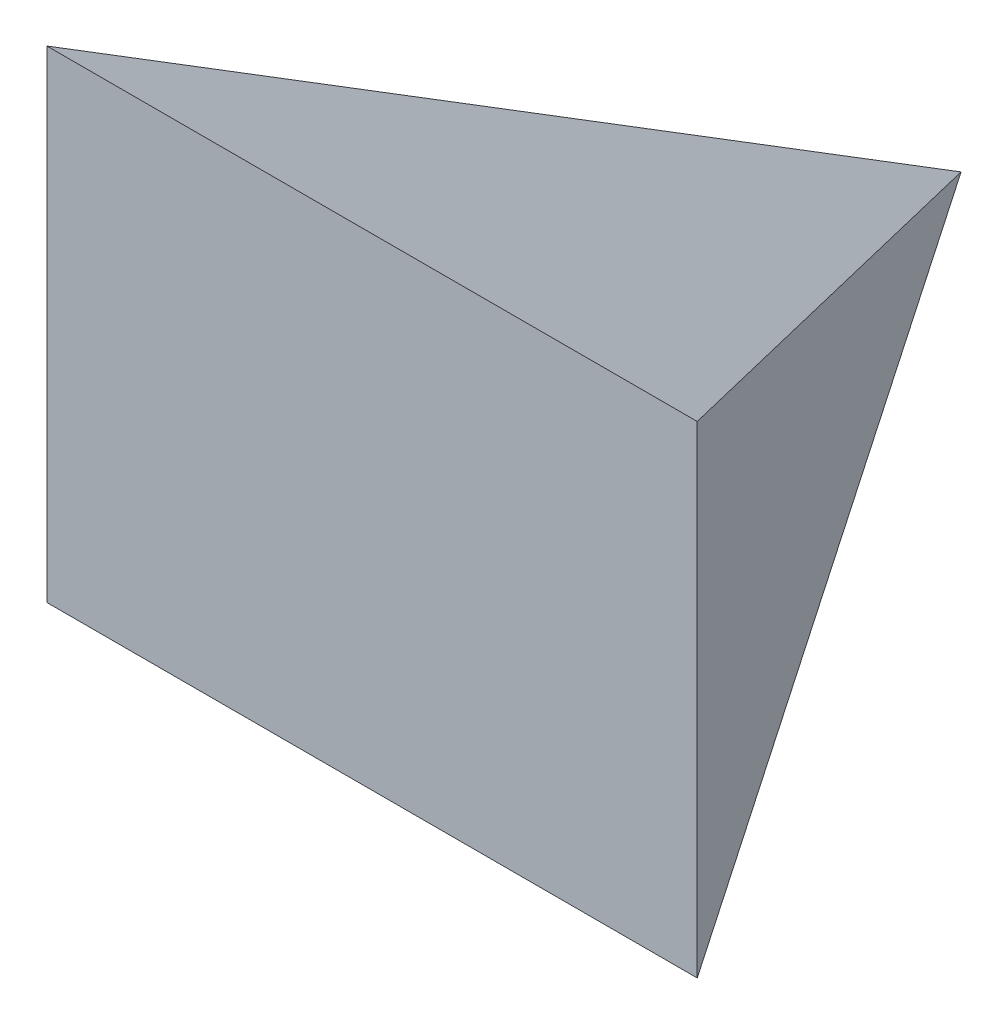
ISO-10303-21;
HEADER;
FILE_DESCRIPTION(('STEP AP214'),'2;1');
FILE_NAME('part.step','',(''),(''),'','','');
FILE_SCHEMA(('AUTOMOTIVE_DESIGN { 1 0 10303 214 1 1 1 1 }'));
ENDSEC;
DATA;
#1=APPLICATION_CONTEXT('core data for automotive mechanical design processes');
#2=APPLICATION_PROTOCOL_DEFINITION('international standard','automotive_design',2000,#1);
#3=PRODUCT_CONTEXT('',#1,'mechanical');
#4=PRODUCT('Part','Part','',(#3));
#5=PRODUCT_RELATED_PRODUCT_CATEGORY('part','',(#4));
#6=PRODUCT_DEFINITION_FORMATION('','',#4);
#7=PRODUCT_DEFINITION_CONTEXT('part definition',#1,'design');
#8=PRODUCT_DEFINITION('design','',#6,#7);
#9=PRODUCT_DEFINITION_SHAPE('','',#8);
#10=(LENGTH_UNIT() NAMED_UNIT(*) SI_UNIT(.MILLI.,.METRE.));
#11=(NAMED_UNIT(*) PLANE_ANGLE_UNIT() SI_UNIT($,.RADIAN.));
#12=(NAMED_UNIT(*) SI_UNIT($,.STERADIAN.) SOLID_ANGLE_UNIT());
#13=UNCERTAINTY_MEASURE_WITH_UNIT(LENGTH_MEASURE(1.E-05),#10,'distance_accuracy_value','');
#14=(GEOMETRIC_REPRESENTATION_CONTEXT(3) GLOBAL_UNCERTAINTY_ASSIGNED_CONTEXT((#13)) GLOBAL_UNIT_ASSIGNED_CONTEXT((#10,
#11,#12)) REPRESENTATION_CONTEXT('',''));
#15=CARTESIAN_POINT('',(0.,0.,0.));
#16=DIRECTION('',(0.,0.,1.));
#17=DIRECTION('',(1.,0.,0.));
#18=AXIS2_PLACEMENT_3D('',#15,#16,#17);
#19=CARTESIAN_POINT('',(165.608897339706,250.,300.));
#20=DIRECTION('',(-0.875464527000019,0.,0.483282383255));
#21=DIRECTION('',(0.483282383255,0.,0.875464527000019));
#22=AXIS2_PLACEMENT_3D('',#19,#20,#21);
#23=PLANE('',#22);
#24=DIRECTION('',(0.45498022040098,-0.337187178210936,0.824195247434746));
#25=VECTOR('',#24,1.);
#26=CARTESIAN_POINT('',(127.603274686984,30.432838191824,231.152933332871));
#27=LINE('',#26,#25);
#28=CARTESIAN_POINT('',(0.,125.,0.));
#29=VERTEX_POINT('',#28);
#30=CARTESIAN_POINT('',(165.608897339706,2.266759571688,300.));
#31=VERTEX_POINT('',#30);
#32=EDGE_CURVE('E66',#29,#31,#27,.T.);
#33=ORIENTED_EDGE('',*,*,#32,.F.);
#34=DIRECTION('',(-0.45498022040098,-0.337187178210936,-0.824195247434746));
#35=VECTOR('',#34,1.);
#36=CARTESIAN_POINT('',(165.956648851683,247.990960095639,300.629950777217));
#37=LINE('',#36,#35);
#38=CARTESIAN_POINT('',(165.608897339706,247.733240428312,300.));
#39=VERTEX_POINT('',#38);
#40=EDGE_CURVE('E80',#39,#29,#37,.T.);
#41=ORIENTED_EDGE('',*,*,#40,.F.);
#42=DIRECTION('',(0.,-1.,0.));
#43=VECTOR('',#42,1.);
#44=CARTESIAN_POINT('',(165.608897339706,250.,300.));
#45=LINE('',#44,#43);
#46=EDGE_CURVE('E44',#39,#31,#45,.T.);
#47=ORIENTED_EDGE('',*,*,#46,.T.);
#48=EDGE_LOOP('',(#33,#41,#47));
#49=FACE_BOUND('',#48,.T.);
#50=ADVANCED_FACE('F37',(#49),#23,.F.);
#51=CARTESIAN_POINT('',(0.,250.,0.));
#52=DIRECTION('',(0.875464527000019,0.,0.483282383255));
#53=DIRECTION('',(0.483282383255,0.,-0.875464527000019));
#54=AXIS2_PLACEMENT_3D('',#51,#52,#53);
#55=PLANE('',#54);
#56=DIRECTION('',(0.45498022040098,0.337187178210936,-0.824195247434746));
#57=VECTOR('',#56,1.);
#58=CARTESIAN_POINT('',(19.1766870823495,139.211899143732,-34.7385087221733));
#59=LINE('',#58,#57);
#60=CARTESIAN_POINT('',(-165.608897339706,2.266759571688,300.));
#61=VERTEX_POINT('',#60);
#62=EDGE_CURVE('E59',#61,#29,#59,.T.);
#63=ORIENTED_EDGE('',*,*,#62,.F.);
#64=DIRECTION('',(0.,-1.,0.));
#65=VECTOR('',#64,1.);
#66=CARTESIAN_POINT('',(-165.608897339706,250.,300.));
#67=LINE('',#66,#65);
#68=CARTESIAN_POINT('',(-165.608897339706,247.733240428312,300.));
#69=VERTEX_POINT('',#68);
#70=EDGE_CURVE('E12',#69,#61,#67,.T.);
#71=ORIENTED_EDGE('',*,*,#70,.F.);
#72=DIRECTION('',(-0.45498022040098,0.337187178210936,0.824195247434746));
#73=VECTOR('',#72,1.);
#74=CARTESIAN_POINT('',(-19.1766870823495,139.211899143732,34.7385087221732));
#75=LINE('',#74,#73);
#76=EDGE_CURVE('E51',#29,#69,#75,.T.);
#77=ORIENTED_EDGE('',*,*,#76,.F.);
#78=EDGE_LOOP('',(#63,#71,#77));
#79=FACE_BOUND('',#78,.T.);
#80=ADVANCED_FACE('F87',(#79),#55,.F.);
#81=CARTESIAN_POINT('',(-165.608897339706,250.,300.));
#82=DIRECTION('',(0.,0.,-1.));
#83=DIRECTION('',(-1.,0.,0.));
#84=AXIS2_PLACEMENT_3D('',#81,#82,#83);
#85=PLANE('',#84);
#86=DIRECTION('',(1.,0.,0.));
#87=VECTOR('',#86,1.);
#88=CARTESIAN_POINT('',(-165.608897339706,2.266759571688,300.));
#89=LINE('',#88,#87);
#90=EDGE_CURVE('E69',#61,#31,#89,.T.);
#91=ORIENTED_EDGE('',*,*,#90,.T.);
#92=ORIENTED_EDGE('',*,*,#46,.F.);
#93=DIRECTION('',(1.,0.,0.));
#94=VECTOR('',#93,1.);
#95=CARTESIAN_POINT('',(-165.608897339706,247.733240428312,300.));
#96=LINE('',#95,#94);
#97=EDGE_CURVE('E78',#69,#39,#96,.T.);
#98=ORIENTED_EDGE('',*,*,#97,.F.);
#99=ORIENTED_EDGE('',*,*,#70,.T.);
#100=EDGE_LOOP('',(#91,#92,#98,#99));
#101=FACE_BOUND('',#100,.T.);
#102=ADVANCED_FACE('F76',(#101),#85,.F.);
#103=CARTESIAN_POINT('',(-165.608897339706,125.,0.));
#104=DIRECTION('',(0.,0.925540504017567,-0.37864861735243));
#105=DIRECTION('',(0.,0.37864861735243,0.925540504017568));
#106=AXIS2_PLACEMENT_3D('',#103,#104,#105);
#107=PLANE('',#106);
#108=ORIENTED_EDGE('',*,*,#40,.T.);
#109=ORIENTED_EDGE('',*,*,#76,.T.);
#110=ORIENTED_EDGE('',*,*,#97,.T.);
#111=EDGE_LOOP('',(#108,#109,#110));
#112=FACE_BOUND('',#111,.T.);
#113=ADVANCED_FACE('F85',(#112),#107,.T.);
#114=CARTESIAN_POINT('',(-165.608897339706,2.266759571688,300.));
#115=DIRECTION('',(0.,-0.925540504017567,-0.37864861735243));
#116=DIRECTION('',(0.,0.37864861735243,-0.925540504017567));
#117=AXIS2_PLACEMENT_3D('',#114,#115,#116);
#118=PLANE('',#117);
#119=ORIENTED_EDGE('',*,*,#32,.T.);
#120=ORIENTED_EDGE('',*,*,#90,.F.);
#121=ORIENTED_EDGE('',*,*,#62,.T.);
#122=EDGE_LOOP('',(#119,#120,#121));
#123=FACE_BOUND('',#122,.T.);
#124=ADVANCED_FACE('F68',(#123),#118,.T.);
#125=CLOSED_SHELL('',(#50,#80,#102,#113,#124));
#126=MANIFOLD_SOLID_BREP('B2',#125);
#127=ADVANCED_BREP_SHAPE_REPRESENTATION('',(#18,#126),#14);
#128=SHAPE_DEFINITION_REPRESENTATION(#9,#127);
ENDSEC;
END-ISO-10303-21;
